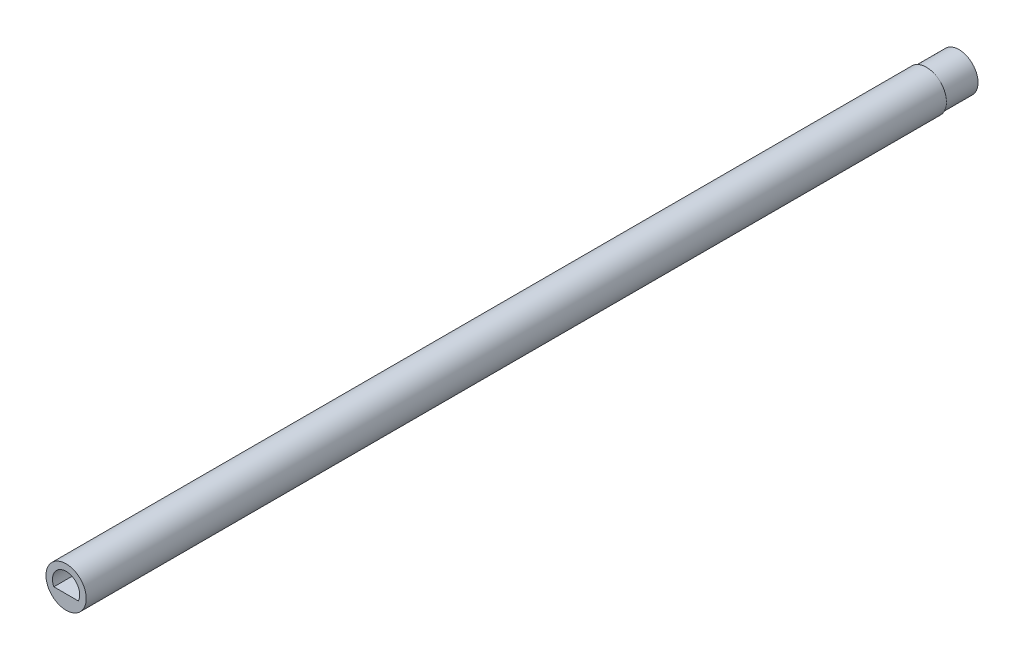
ISO-10303-21;
HEADER;
FILE_DESCRIPTION(('STEP AP214'),'2;1');
FILE_NAME('part.step','',(''),(''),'','','');
FILE_SCHEMA(('AUTOMOTIVE_DESIGN { 1 0 10303 214 1 1 1 1 }'));
ENDSEC;
DATA;
#1=APPLICATION_CONTEXT('core data for automotive mechanical design processes');
#2=APPLICATION_PROTOCOL_DEFINITION('international standard','automotive_design',2000,#1);
#3=PRODUCT_CONTEXT('',#1,'mechanical');
#4=PRODUCT('Part','Part','',(#3));
#5=PRODUCT_RELATED_PRODUCT_CATEGORY('part','',(#4));
#6=PRODUCT_DEFINITION_FORMATION('','',#4);
#7=PRODUCT_DEFINITION_CONTEXT('part definition',#1,'design');
#8=PRODUCT_DEFINITION('design','',#6,#7);
#9=PRODUCT_DEFINITION_SHAPE('','',#8);
#10=(LENGTH_UNIT() NAMED_UNIT(*) SI_UNIT(.MILLI.,.METRE.));
#11=(NAMED_UNIT(*) PLANE_ANGLE_UNIT() SI_UNIT($,.RADIAN.));
#12=(NAMED_UNIT(*) SI_UNIT($,.STERADIAN.) SOLID_ANGLE_UNIT());
#13=UNCERTAINTY_MEASURE_WITH_UNIT(LENGTH_MEASURE(1.E-05),#10,'distance_accuracy_value','');
#14=(GEOMETRIC_REPRESENTATION_CONTEXT(3) GLOBAL_UNCERTAINTY_ASSIGNED_CONTEXT((#13)) GLOBAL_UNIT_ASSIGNED_CONTEXT((#10,
#11,#12)) REPRESENTATION_CONTEXT('',''));
#15=CARTESIAN_POINT('',(0.,0.,0.));
#16=DIRECTION('',(0.,0.,1.));
#17=DIRECTION('',(1.,0.,0.));
#18=AXIS2_PLACEMENT_3D('',#15,#16,#17);
#19=CARTESIAN_POINT('',(0.,0.,158.));
#20=DIRECTION('',(0.,0.,-1.));
#21=DIRECTION('',(-1.,0.,0.));
#22=AXIS2_PLACEMENT_3D('',#19,#20,#21);
#23=CYLINDRICAL_SURFACE('',#22,3.7);
#24=CARTESIAN_POINT('',(0.,0.,158.));
#25=DIRECTION('',(0.,0.,1.));
#26=DIRECTION('',(1.,0.,0.));
#27=AXIS2_PLACEMENT_3D('',#24,#25,#26);
#28=CIRCLE('',#27,3.7);
#29=CARTESIAN_POINT('',(3.7,0.,158.));
#30=VERTEX_POINT('',#29);
#31=EDGE_CURVE('E44',#30,#30,#28,.T.);
#32=ORIENTED_EDGE('',*,*,#31,.F.);
#33=EDGE_LOOP('',(#32));
#34=FACE_BOUND('',#33,.T.);
#35=CARTESIAN_POINT('',(0.,0.,0.));
#36=DIRECTION('',(0.,0.,1.));
#37=DIRECTION('',(1.,0.,0.));
#38=AXIS2_PLACEMENT_3D('',#35,#36,#37);
#39=CIRCLE('',#38,3.7);
#40=CARTESIAN_POINT('',(3.7,0.,0.));
#41=VERTEX_POINT('',#40);
#42=EDGE_CURVE('E39',#41,#41,#39,.T.);
#43=ORIENTED_EDGE('',*,*,#42,.T.);
#44=EDGE_LOOP('',(#43));
#45=FACE_BOUND('',#44,.T.);
#46=ADVANCED_FACE('F36',(#34,#45),#23,.T.);
#47=CARTESIAN_POINT('',(0.,0.,158.));
#48=DIRECTION('',(0.,0.,1.));
#49=DIRECTION('',(1.,0.,0.));
#50=AXIS2_PLACEMENT_3D('',#47,#48,#49);
#51=PLANE('',#50);
#52=CARTESIAN_POINT('',(0.,0.,158.));
#53=DIRECTION('',(0.,0.,1.));
#54=DIRECTION('',(-1.,0.,0.));
#55=AXIS2_PLACEMENT_3D('',#52,#53,#54);
#56=CIRCLE('',#55,2.5);
#57=CARTESIAN_POINT('',(2.25,-1.08972473588517,158.));
#58=VERTEX_POINT('',#57);
#59=CARTESIAN_POINT('',(-2.25,-1.08972473588517,158.));
#60=VERTEX_POINT('',#59);
#61=EDGE_CURVE('E52',#58,#60,#56,.T.);
#62=ORIENTED_EDGE('',*,*,#61,.F.);
#63=DIRECTION('',(1.,0.,0.));
#64=VECTOR('',#63,1.);
#65=CARTESIAN_POINT('',(-2.25,-1.08972473588517,158.));
#66=LINE('',#65,#64);
#67=EDGE_CURVE('E72',#60,#58,#66,.T.);
#68=ORIENTED_EDGE('',*,*,#67,.F.);
#69=EDGE_LOOP('',(#62,#68));
#70=FACE_BOUND('',#69,.T.);
#71=ORIENTED_EDGE('',*,*,#31,.T.);
#72=EDGE_LOOP('',(#71));
#73=FACE_BOUND('',#72,.T.);
#74=ADVANCED_FACE('F76',(#70,#73),#51,.T.);
#75=CARTESIAN_POINT('',(0.,0.,0.));
#76=DIRECTION('',(0.,0.,1.));
#77=DIRECTION('',(1.,0.,0.));
#78=AXIS2_PLACEMENT_3D('',#75,#76,#77);
#79=PLANE('',#78);
#80=CARTESIAN_POINT('',(0.,0.,0.));
#81=DIRECTION('',(0.,0.,-1.));
#82=DIRECTION('',(-1.,0.,0.));
#83=AXIS2_PLACEMENT_3D('',#80,#81,#82);
#84=CIRCLE('',#83,3.5);
#85=CARTESIAN_POINT('',(-3.5,0.,0.));
#86=VERTEX_POINT('',#85);
#87=EDGE_CURVE('E11',#86,#86,#84,.T.);
#88=ORIENTED_EDGE('',*,*,#87,.F.);
#89=EDGE_LOOP('',(#88));
#90=FACE_BOUND('',#89,.T.);
#91=ORIENTED_EDGE('',*,*,#42,.F.);
#92=EDGE_LOOP('',(#91));
#93=FACE_BOUND('',#92,.T.);
#94=ADVANCED_FACE('F91',(#90,#93),#79,.F.);
#95=CARTESIAN_POINT('',(0.,0.,-6.));
#96=DIRECTION('',(0.,0.,1.));
#97=DIRECTION('',(1.,0.,0.));
#98=AXIS2_PLACEMENT_3D('',#95,#96,#97);
#99=CYLINDRICAL_SURFACE('',#98,3.5);
#100=CARTESIAN_POINT('',(0.,0.,-6.));
#101=DIRECTION('',(0.,0.,-1.));
#102=DIRECTION('',(-1.,0.,0.));
#103=AXIS2_PLACEMENT_3D('',#100,#101,#102);
#104=CIRCLE('',#103,3.5);
#105=CARTESIAN_POINT('',(-3.5,0.,-6.));
#106=VERTEX_POINT('',#105);
#107=EDGE_CURVE('E68',#106,#106,#104,.T.);
#108=ORIENTED_EDGE('',*,*,#107,.F.);
#109=EDGE_LOOP('',(#108));
#110=FACE_BOUND('',#109,.T.);
#111=ORIENTED_EDGE('',*,*,#87,.T.);
#112=EDGE_LOOP('',(#111));
#113=FACE_BOUND('',#112,.T.);
#114=ADVANCED_FACE('F93',(#110,#113),#99,.T.);
#115=CARTESIAN_POINT('',(0.,0.,-6.));
#116=DIRECTION('',(0.,0.,-1.));
#117=DIRECTION('',(-1.,0.,0.));
#118=AXIS2_PLACEMENT_3D('',#115,#116,#117);
#119=PLANE('',#118);
#120=ORIENTED_EDGE('',*,*,#107,.T.);
#121=EDGE_LOOP('',(#120));
#122=FACE_BOUND('',#121,.T.);
#123=ADVANCED_FACE('F99',(#122),#119,.T.);
#124=CARTESIAN_POINT('',(0.,0.,148.));
#125=DIRECTION('',(0.,0.,1.));
#126=DIRECTION('',(1.,0.,0.));
#127=AXIS2_PLACEMENT_3D('',#124,#125,#126);
#128=CYLINDRICAL_SURFACE('',#127,2.5);
#129=ORIENTED_EDGE('',*,*,#61,.T.);
#130=DIRECTION('',(0.,0.,1.));
#131=VECTOR('',#130,1.);
#132=CARTESIAN_POINT('',(-2.25,-1.08972473588517,148.));
#133=LINE('',#132,#131);
#134=CARTESIAN_POINT('',(-2.25,-1.08972473588517,148.));
#135=VERTEX_POINT('',#134);
#136=EDGE_CURVE('E69',#135,#60,#133,.T.);
#137=ORIENTED_EDGE('',*,*,#136,.F.);
#138=CARTESIAN_POINT('',(0.,0.,148.));
#139=DIRECTION('',(0.,0.,1.));
#140=DIRECTION('',(-1.,0.,0.));
#141=AXIS2_PLACEMENT_3D('',#138,#139,#140);
#142=CIRCLE('',#141,2.5);
#143=CARTESIAN_POINT('',(2.25,-1.08972473588517,148.));
#144=VERTEX_POINT('',#143);
#145=EDGE_CURVE('E66',#144,#135,#142,.T.);
#146=ORIENTED_EDGE('',*,*,#145,.F.);
#147=DIRECTION('',(0.,0.,1.));
#148=VECTOR('',#147,1.);
#149=CARTESIAN_POINT('',(2.25,-1.08972473588517,148.));
#150=LINE('',#149,#148);
#151=EDGE_CURVE('E60',#144,#58,#150,.T.);
#152=ORIENTED_EDGE('',*,*,#151,.T.);
#153=EDGE_LOOP('',(#129,#137,#146,#152));
#154=FACE_BOUND('',#153,.T.);
#155=ADVANCED_FACE('F64',(#154),#128,.F.);
#156=CARTESIAN_POINT('',(-2.25,-1.08972473588517,148.));
#157=DIRECTION('',(0.,-1.,0.));
#158=DIRECTION('',(1.,0.,0.));
#159=AXIS2_PLACEMENT_3D('',#156,#157,#158);
#160=PLANE('',#159);
#161=ORIENTED_EDGE('',*,*,#67,.T.);
#162=ORIENTED_EDGE('',*,*,#151,.F.);
#163=DIRECTION('',(1.,0.,0.));
#164=VECTOR('',#163,1.);
#165=CARTESIAN_POINT('',(-2.25,-1.08972473588517,148.));
#166=LINE('',#165,#164);
#167=EDGE_CURVE('E80',#135,#144,#166,.T.);
#168=ORIENTED_EDGE('',*,*,#167,.F.);
#169=ORIENTED_EDGE('',*,*,#136,.T.);
#170=EDGE_LOOP('',(#161,#162,#168,#169));
#171=FACE_BOUND('',#170,.T.);
#172=ADVANCED_FACE('F73',(#171),#160,.F.);
#173=CARTESIAN_POINT('',(0.,0.,148.));
#174=DIRECTION('',(0.,0.,-1.));
#175=DIRECTION('',(-1.,0.,0.));
#176=AXIS2_PLACEMENT_3D('',#173,#174,#175);
#177=PLANE('',#176);
#178=ORIENTED_EDGE('',*,*,#145,.T.);
#179=ORIENTED_EDGE('',*,*,#167,.T.);
#180=EDGE_LOOP('',(#178,#179));
#181=FACE_BOUND('',#180,.T.);
#182=ADVANCED_FACE('F135',(#181),#177,.F.);
#183=CLOSED_SHELL('',(#46,#74,#94,#114,#123,#155,#172,#182));
#184=MANIFOLD_SOLID_BREP('B2',#183);
#185=ADVANCED_BREP_SHAPE_REPRESENTATION('',(#18,#184),#14);
#186=SHAPE_DEFINITION_REPRESENTATION(#9,#185);
ENDSEC;
END-ISO-10303-21;
